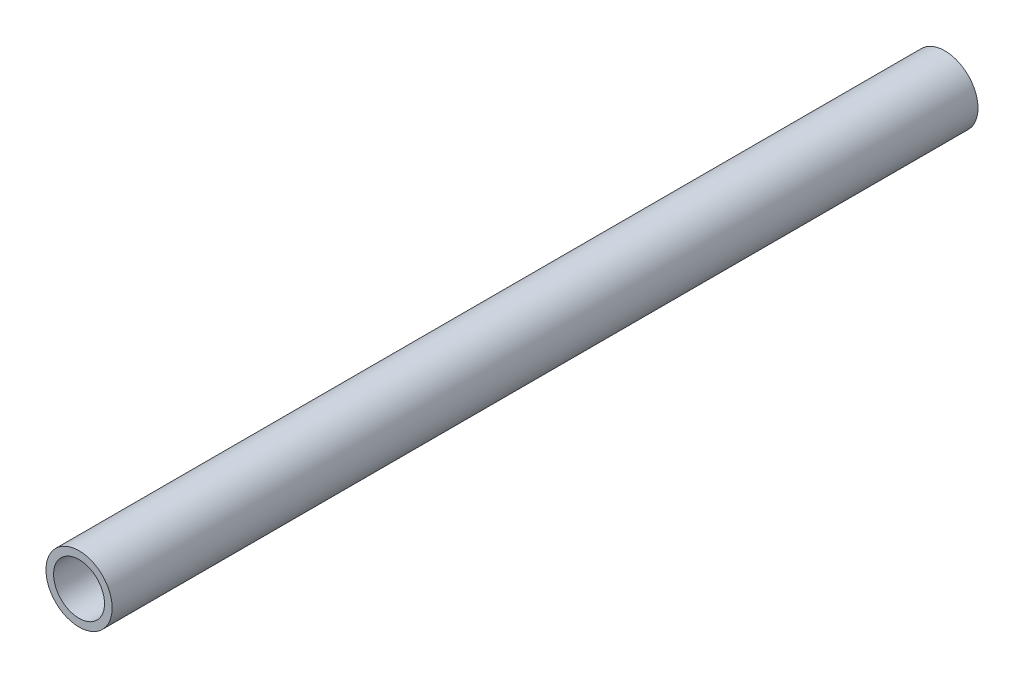
ISO-10303-21;
HEADER;
FILE_DESCRIPTION(('STEP AP214'),'2;1');
FILE_NAME('part.step','',(''),(''),'','','');
FILE_SCHEMA(('AUTOMOTIVE_DESIGN { 1 0 10303 214 1 1 1 1 }'));
ENDSEC;
DATA;
#1=APPLICATION_CONTEXT('core data for automotive mechanical design processes');
#2=APPLICATION_PROTOCOL_DEFINITION('international standard','automotive_design',2000,#1);
#3=PRODUCT_CONTEXT('',#1,'mechanical');
#4=PRODUCT('Part','Part','',(#3));
#5=PRODUCT_RELATED_PRODUCT_CATEGORY('part','',(#4));
#6=PRODUCT_DEFINITION_FORMATION('','',#4);
#7=PRODUCT_DEFINITION_CONTEXT('part definition',#1,'design');
#8=PRODUCT_DEFINITION('design','',#6,#7);
#9=PRODUCT_DEFINITION_SHAPE('','',#8);
#10=(LENGTH_UNIT() NAMED_UNIT(*) SI_UNIT(.MILLI.,.METRE.));
#11=(NAMED_UNIT(*) PLANE_ANGLE_UNIT() SI_UNIT($,.RADIAN.));
#12=(NAMED_UNIT(*) SI_UNIT($,.STERADIAN.) SOLID_ANGLE_UNIT());
#13=UNCERTAINTY_MEASURE_WITH_UNIT(LENGTH_MEASURE(1.E-05),#10,'distance_accuracy_value','');
#14=(GEOMETRIC_REPRESENTATION_CONTEXT(3) GLOBAL_UNCERTAINTY_ASSIGNED_CONTEXT((#13)) GLOBAL_UNIT_ASSIGNED_CONTEXT((#10,
#11,#12)) REPRESENTATION_CONTEXT('',''));
#15=CARTESIAN_POINT('',(0.,0.,0.));
#16=DIRECTION('',(0.,0.,1.));
#17=DIRECTION('',(1.,0.,0.));
#18=AXIS2_PLACEMENT_3D('',#15,#16,#17);
#19=CARTESIAN_POINT('',(0.,0.,85.));
#20=DIRECTION('',(0.,0.,1.));
#21=DIRECTION('',(1.,0.,0.));
#22=AXIS2_PLACEMENT_3D('',#19,#20,#21);
#23=PLANE('',#22);
#24=CARTESIAN_POINT('',(0.,0.,85.));
#25=DIRECTION('',(0.,0.,1.));
#26=DIRECTION('',(1.,0.,0.));
#27=AXIS2_PLACEMENT_3D('',#24,#25,#26);
#28=CIRCLE('',#27,6.5);
#29=CARTESIAN_POINT('',(6.5,0.,85.));
#30=VERTEX_POINT('',#29);
#31=EDGE_CURVE('E10',#30,#30,#28,.T.);
#32=ORIENTED_EDGE('',*,*,#31,.T.);
#33=EDGE_LOOP('',(#32));
#34=FACE_BOUND('',#33,.T.);
#35=CARTESIAN_POINT('',(0.,0.,85.));
#36=DIRECTION('',(0.,0.,1.));
#37=DIRECTION('',(1.,0.,0.));
#38=AXIS2_PLACEMENT_3D('',#35,#36,#37);
#39=CIRCLE('',#38,5.);
#40=CARTESIAN_POINT('',(5.,0.,85.));
#41=VERTEX_POINT('',#40);
#42=EDGE_CURVE('E50',#41,#41,#39,.T.);
#43=ORIENTED_EDGE('',*,*,#42,.F.);
#44=EDGE_LOOP('',(#43));
#45=FACE_BOUND('',#44,.T.);
#46=ADVANCED_FACE('F37',(#34,#45),#23,.T.);
#47=CARTESIAN_POINT('',(0.,0.,-85.));
#48=DIRECTION('',(0.,0.,1.));
#49=DIRECTION('',(1.,0.,0.));
#50=AXIS2_PLACEMENT_3D('',#47,#48,#49);
#51=PLANE('',#50);
#52=CARTESIAN_POINT('',(0.,0.,-85.));
#53=DIRECTION('',(0.,0.,1.));
#54=DIRECTION('',(1.,0.,0.));
#55=AXIS2_PLACEMENT_3D('',#52,#53,#54);
#56=CIRCLE('',#55,6.5);
#57=CARTESIAN_POINT('',(6.5,0.,-85.));
#58=VERTEX_POINT('',#57);
#59=EDGE_CURVE('E41',#58,#58,#56,.T.);
#60=ORIENTED_EDGE('',*,*,#59,.F.);
#61=EDGE_LOOP('',(#60));
#62=FACE_BOUND('',#61,.T.);
#63=CARTESIAN_POINT('',(0.,0.,-85.));
#64=DIRECTION('',(0.,0.,1.));
#65=DIRECTION('',(1.,0.,0.));
#66=AXIS2_PLACEMENT_3D('',#63,#64,#65);
#67=CIRCLE('',#66,5.);
#68=CARTESIAN_POINT('',(5.,0.,-85.));
#69=VERTEX_POINT('',#68);
#70=EDGE_CURVE('E52',#69,#69,#67,.T.);
#71=ORIENTED_EDGE('',*,*,#70,.T.);
#72=EDGE_LOOP('',(#71));
#73=FACE_BOUND('',#72,.T.);
#74=ADVANCED_FACE('F64',(#62,#73),#51,.F.);
#75=CARTESIAN_POINT('',(0.,0.,85.));
#76=DIRECTION('',(0.,0.,-1.));
#77=DIRECTION('',(-1.,0.,0.));
#78=AXIS2_PLACEMENT_3D('',#75,#76,#77);
#79=CYLINDRICAL_SURFACE('',#78,6.5);
#80=ORIENTED_EDGE('',*,*,#31,.F.);
#81=EDGE_LOOP('',(#80));
#82=FACE_BOUND('',#81,.T.);
#83=ORIENTED_EDGE('',*,*,#59,.T.);
#84=EDGE_LOOP('',(#83));
#85=FACE_BOUND('',#84,.T.);
#86=ADVANCED_FACE('F39',(#82,#85),#79,.T.);
#87=CARTESIAN_POINT('',(0.,0.,85.));
#88=DIRECTION('',(0.,0.,-1.));
#89=DIRECTION('',(-1.,0.,0.));
#90=AXIS2_PLACEMENT_3D('',#87,#88,#89);
#91=CYLINDRICAL_SURFACE('',#90,5.);
#92=ORIENTED_EDGE('',*,*,#42,.T.);
#93=EDGE_LOOP('',(#92));
#94=FACE_BOUND('',#93,.T.);
#95=ORIENTED_EDGE('',*,*,#70,.F.);
#96=EDGE_LOOP('',(#95));
#97=FACE_BOUND('',#96,.T.);
#98=ADVANCED_FACE('F60',(#94,#97),#91,.F.);
#99=CLOSED_SHELL('',(#46,#74,#86,#98));
#100=MANIFOLD_SOLID_BREP('B2',#99);
#101=ADVANCED_BREP_SHAPE_REPRESENTATION('',(#18,#100),#14);
#102=SHAPE_DEFINITION_REPRESENTATION(#9,#101);
ENDSEC;
END-ISO-10303-21;
